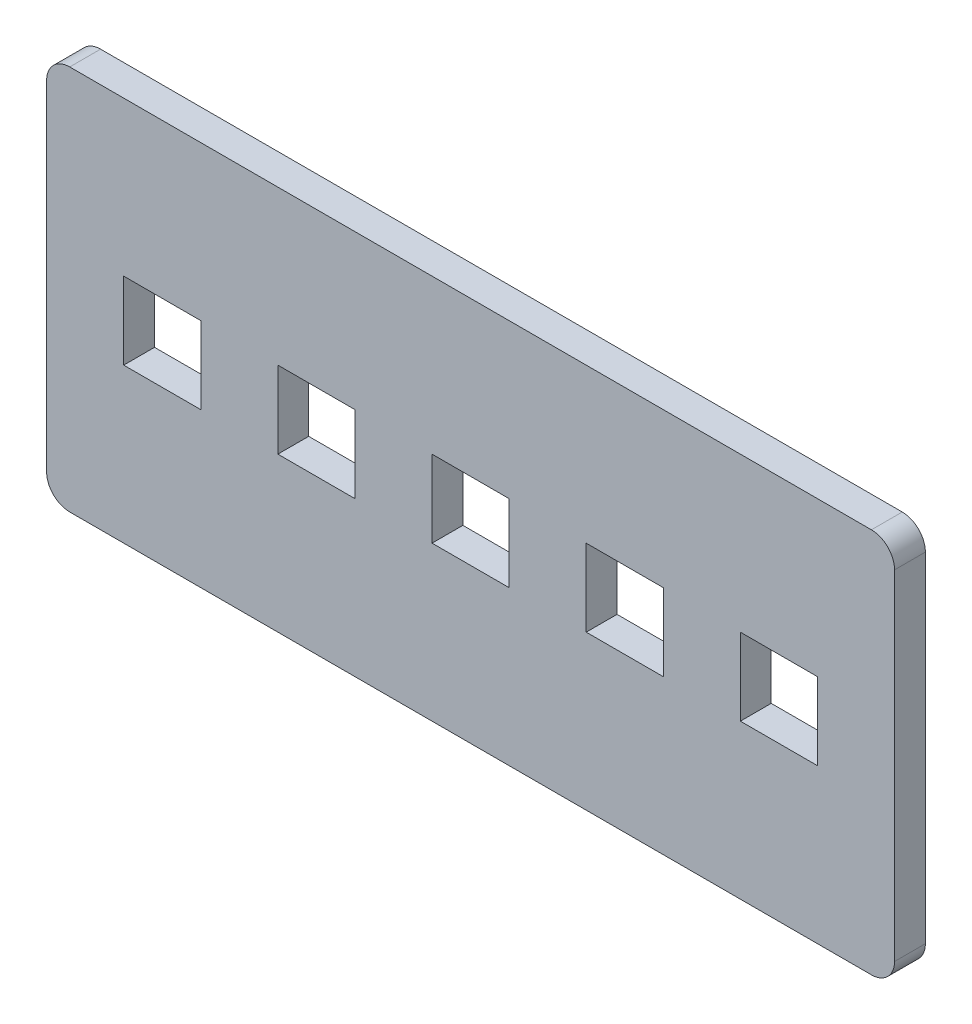
ISO-10303-21;
HEADER;
FILE_DESCRIPTION(('STEP AP214'),'2;1');
FILE_NAME('part.step','',(''),(''),'','','');
FILE_SCHEMA(('AUTOMOTIVE_DESIGN { 1 0 10303 214 1 1 1 1 }'));
ENDSEC;
DATA;
#1=APPLICATION_CONTEXT('core data for automotive mechanical design processes');
#2=APPLICATION_PROTOCOL_DEFINITION('international standard','automotive_design',2000,#1);
#3=PRODUCT_CONTEXT('',#1,'mechanical');
#4=PRODUCT('Part','Part','',(#3));
#5=PRODUCT_RELATED_PRODUCT_CATEGORY('part','',(#4));
#6=PRODUCT_DEFINITION_FORMATION('','',#4);
#7=PRODUCT_DEFINITION_CONTEXT('part definition',#1,'design');
#8=PRODUCT_DEFINITION('design','',#6,#7);
#9=PRODUCT_DEFINITION_SHAPE('','',#8);
#10=(LENGTH_UNIT() NAMED_UNIT(*) SI_UNIT(.MILLI.,.METRE.));
#11=(NAMED_UNIT(*) PLANE_ANGLE_UNIT() SI_UNIT($,.RADIAN.));
#12=(NAMED_UNIT(*) SI_UNIT($,.STERADIAN.) SOLID_ANGLE_UNIT());
#13=UNCERTAINTY_MEASURE_WITH_UNIT(LENGTH_MEASURE(1.E-05),#10,'distance_accuracy_value','');
#14=(GEOMETRIC_REPRESENTATION_CONTEXT(3) GLOBAL_UNCERTAINTY_ASSIGNED_CONTEXT((#13)) GLOBAL_UNIT_ASSIGNED_CONTEXT((#10,
#11,#12)) REPRESENTATION_CONTEXT('',''));
#15=CARTESIAN_POINT('',(0.,0.,0.));
#16=DIRECTION('',(0.,0.,1.));
#17=DIRECTION('',(1.,0.,0.));
#18=AXIS2_PLACEMENT_3D('',#15,#16,#17);
#19=CARTESIAN_POINT('',(0.,0.,4.));
#20=DIRECTION('',(0.,0.,1.));
#21=DIRECTION('',(1.,0.,0.));
#22=AXIS2_PLACEMENT_3D('',#19,#20,#21);
#23=PLANE('',#22);
#24=DIRECTION('',(0.,1.,0.));
#25=VECTOR('',#24,1.);
#26=CARTESIAN_POINT('',(55.,-25.,4.));
#27=LINE('',#26,#25);
#28=CARTESIAN_POINT('',(55.,-22.,4.));
#29=VERTEX_POINT('',#28);
#30=CARTESIAN_POINT('',(55.,22.,4.));
#31=VERTEX_POINT('',#30);
#32=EDGE_CURVE('E389',#29,#31,#27,.T.);
#33=ORIENTED_EDGE('',*,*,#32,.T.);
#34=CARTESIAN_POINT('',(52.,22.,4.));
#35=DIRECTION('',(0.,0.,1.));
#36=DIRECTION('',(1.,0.,0.));
#37=AXIS2_PLACEMENT_3D('',#34,#35,#36);
#38=CIRCLE('',#37,3.);
#39=CARTESIAN_POINT('',(52.,25.,4.));
#40=VERTEX_POINT('',#39);
#41=EDGE_CURVE('E427',#31,#40,#38,.T.);
#42=ORIENTED_EDGE('',*,*,#41,.T.);
#43=DIRECTION('',(-1.,0.,0.));
#44=VECTOR('',#43,1.);
#45=CARTESIAN_POINT('',(55.,25.,4.));
#46=LINE('',#45,#44);
#47=CARTESIAN_POINT('',(-52.,25.,4.));
#48=VERTEX_POINT('',#47);
#49=EDGE_CURVE('E392',#40,#48,#46,.T.);
#50=ORIENTED_EDGE('',*,*,#49,.T.);
#51=CARTESIAN_POINT('',(-52.,22.,4.));
#52=DIRECTION('',(0.,0.,1.));
#53=DIRECTION('',(1.,0.,0.));
#54=AXIS2_PLACEMENT_3D('',#51,#52,#53);
#55=CIRCLE('',#54,3.);
#56=CARTESIAN_POINT('',(-55.,22.,4.));
#57=VERTEX_POINT('',#56);
#58=EDGE_CURVE('E422',#48,#57,#55,.T.);
#59=ORIENTED_EDGE('',*,*,#58,.T.);
#60=DIRECTION('',(0.,-1.,0.));
#61=VECTOR('',#60,1.);
#62=CARTESIAN_POINT('',(-55.,-25.,4.));
#63=LINE('',#62,#61);
#64=CARTESIAN_POINT('',(-55.,-22.,4.));
#65=VERTEX_POINT('',#64);
#66=EDGE_CURVE('E384',#57,#65,#63,.T.);
#67=ORIENTED_EDGE('',*,*,#66,.T.);
#68=CARTESIAN_POINT('',(-52.,-22.,4.));
#69=DIRECTION('',(0.,0.,1.));
#70=DIRECTION('',(1.,0.,0.));
#71=AXIS2_PLACEMENT_3D('',#68,#69,#70);
#72=CIRCLE('',#71,3.);
#73=CARTESIAN_POINT('',(-52.,-25.,4.));
#74=VERTEX_POINT('',#73);
#75=EDGE_CURVE('E54',#65,#74,#72,.T.);
#76=ORIENTED_EDGE('',*,*,#75,.T.);
#77=DIRECTION('',(1.,0.,0.));
#78=VECTOR('',#77,1.);
#79=CARTESIAN_POINT('',(55.,-25.,4.));
#80=LINE('',#79,#78);
#81=CARTESIAN_POINT('',(52.,-25.,4.));
#82=VERTEX_POINT('',#81);
#83=EDGE_CURVE('E386',#74,#82,#80,.T.);
#84=ORIENTED_EDGE('',*,*,#83,.T.);
#85=CARTESIAN_POINT('',(52.,-22.,4.));
#86=DIRECTION('',(0.,0.,1.));
#87=DIRECTION('',(1.,0.,0.));
#88=AXIS2_PLACEMENT_3D('',#85,#86,#87);
#89=CIRCLE('',#88,3.);
#90=EDGE_CURVE('E425',#82,#29,#89,.T.);
#91=ORIENTED_EDGE('',*,*,#90,.T.);
#92=EDGE_LOOP('',(#33,#42,#50,#59,#67,#76,#84,#91));
#93=FACE_BOUND('',#92,.T.);
#94=DIRECTION('',(-1.,0.,0.));
#95=VECTOR('',#94,1.);
#96=CARTESIAN_POINT('',(-45.,5.,4.));
#97=LINE('',#96,#95);
#98=CARTESIAN_POINT('',(-35.,5.,4.));
#99=VERTEX_POINT('',#98);
#100=CARTESIAN_POINT('',(-45.,5.,4.));
#101=VERTEX_POINT('',#100);
#102=EDGE_CURVE('E355',#99,#101,#97,.T.);
#103=ORIENTED_EDGE('',*,*,#102,.F.);
#104=DIRECTION('',(0.,1.,0.));
#105=VECTOR('',#104,1.);
#106=CARTESIAN_POINT('',(-35.,5.,4.));
#107=LINE('',#106,#105);
#108=CARTESIAN_POINT('',(-35.,-5.,4.));
#109=VERTEX_POINT('',#108);
#110=EDGE_CURVE('E353',#109,#99,#107,.T.);
#111=ORIENTED_EDGE('',*,*,#110,.F.);
#112=DIRECTION('',(1.,0.,0.));
#113=VECTOR('',#112,1.);
#114=CARTESIAN_POINT('',(-45.,-5.,4.));
#115=LINE('',#114,#113);
#116=CARTESIAN_POINT('',(-45.,-5.,4.));
#117=VERTEX_POINT('',#116);
#118=EDGE_CURVE('E361',#117,#109,#115,.T.);
#119=ORIENTED_EDGE('',*,*,#118,.F.);
#120=DIRECTION('',(0.,-1.,0.));
#121=VECTOR('',#120,1.);
#122=CARTESIAN_POINT('',(-45.,5.,4.));
#123=LINE('',#122,#121);
#124=EDGE_CURVE('E358',#101,#117,#123,.T.);
#125=ORIENTED_EDGE('',*,*,#124,.F.);
#126=EDGE_LOOP('',(#103,#111,#119,#125));
#127=FACE_BOUND('',#126,.T.);
#128=DIRECTION('',(-1.,0.,0.));
#129=VECTOR('',#128,1.);
#130=CARTESIAN_POINT('',(-25.,5.,4.));
#131=LINE('',#130,#129);
#132=CARTESIAN_POINT('',(-15.,5.,4.));
#133=VERTEX_POINT('',#132);
#134=CARTESIAN_POINT('',(-25.,5.,4.));
#135=VERTEX_POINT('',#134);
#136=EDGE_CURVE('E324',#133,#135,#131,.T.);
#137=ORIENTED_EDGE('',*,*,#136,.F.);
#138=DIRECTION('',(0.,1.,0.));
#139=VECTOR('',#138,1.);
#140=CARTESIAN_POINT('',(-15.,5.,4.));
#141=LINE('',#140,#139);
#142=CARTESIAN_POINT('',(-15.,-5.,4.));
#143=VERTEX_POINT('',#142);
#144=EDGE_CURVE('E322',#143,#133,#141,.T.);
#145=ORIENTED_EDGE('',*,*,#144,.F.);
#146=DIRECTION('',(1.,0.,0.));
#147=VECTOR('',#146,1.);
#148=CARTESIAN_POINT('',(-25.,-5.,4.));
#149=LINE('',#148,#147);
#150=CARTESIAN_POINT('',(-25.,-5.,4.));
#151=VERTEX_POINT('',#150);
#152=EDGE_CURVE('E330',#151,#143,#149,.T.);
#153=ORIENTED_EDGE('',*,*,#152,.F.);
#154=DIRECTION('',(0.,-1.,0.));
#155=VECTOR('',#154,1.);
#156=CARTESIAN_POINT('',(-25.,5.,4.));
#157=LINE('',#156,#155);
#158=EDGE_CURVE('E327',#135,#151,#157,.T.);
#159=ORIENTED_EDGE('',*,*,#158,.F.);
#160=EDGE_LOOP('',(#137,#145,#153,#159));
#161=FACE_BOUND('',#160,.T.);
#162=DIRECTION('',(-1.,0.,0.));
#163=VECTOR('',#162,1.);
#164=CARTESIAN_POINT('',(-5.,5.,4.));
#165=LINE('',#164,#163);
#166=CARTESIAN_POINT('',(5.,5.,4.));
#167=VERTEX_POINT('',#166);
#168=CARTESIAN_POINT('',(-5.,5.,4.));
#169=VERTEX_POINT('',#168);
#170=EDGE_CURVE('E293',#167,#169,#165,.T.);
#171=ORIENTED_EDGE('',*,*,#170,.F.);
#172=DIRECTION('',(0.,1.,0.));
#173=VECTOR('',#172,1.);
#174=CARTESIAN_POINT('',(5.,5.,4.));
#175=LINE('',#174,#173);
#176=CARTESIAN_POINT('',(5.,-5.,4.));
#177=VERTEX_POINT('',#176);
#178=EDGE_CURVE('E291',#177,#167,#175,.T.);
#179=ORIENTED_EDGE('',*,*,#178,.F.);
#180=DIRECTION('',(1.,0.,0.));
#181=VECTOR('',#180,1.);
#182=CARTESIAN_POINT('',(-5.,-5.,4.));
#183=LINE('',#182,#181);
#184=CARTESIAN_POINT('',(-5.,-5.,4.));
#185=VERTEX_POINT('',#184);
#186=EDGE_CURVE('E299',#185,#177,#183,.T.);
#187=ORIENTED_EDGE('',*,*,#186,.F.);
#188=DIRECTION('',(0.,-1.,0.));
#189=VECTOR('',#188,1.);
#190=CARTESIAN_POINT('',(-5.,5.,4.));
#191=LINE('',#190,#189);
#192=EDGE_CURVE('E296',#169,#185,#191,.T.);
#193=ORIENTED_EDGE('',*,*,#192,.F.);
#194=EDGE_LOOP('',(#171,#179,#187,#193));
#195=FACE_BOUND('',#194,.T.);
#196=DIRECTION('',(-1.,0.,0.));
#197=VECTOR('',#196,1.);
#198=CARTESIAN_POINT('',(15.,5.,4.));
#199=LINE('',#198,#197);
#200=CARTESIAN_POINT('',(25.,5.,4.));
#201=VERTEX_POINT('',#200);
#202=CARTESIAN_POINT('',(15.,5.,4.));
#203=VERTEX_POINT('',#202);
#204=EDGE_CURVE('E262',#201,#203,#199,.T.);
#205=ORIENTED_EDGE('',*,*,#204,.F.);
#206=DIRECTION('',(0.,1.,0.));
#207=VECTOR('',#206,1.);
#208=CARTESIAN_POINT('',(25.,5.,4.));
#209=LINE('',#208,#207);
#210=CARTESIAN_POINT('',(25.,-5.,4.));
#211=VERTEX_POINT('',#210);
#212=EDGE_CURVE('E260',#211,#201,#209,.T.);
#213=ORIENTED_EDGE('',*,*,#212,.F.);
#214=DIRECTION('',(1.,0.,0.));
#215=VECTOR('',#214,1.);
#216=CARTESIAN_POINT('',(15.,-5.,4.));
#217=LINE('',#216,#215);
#218=CARTESIAN_POINT('',(15.,-5.,4.));
#219=VERTEX_POINT('',#218);
#220=EDGE_CURVE('E268',#219,#211,#217,.T.);
#221=ORIENTED_EDGE('',*,*,#220,.F.);
#222=DIRECTION('',(0.,-1.,0.));
#223=VECTOR('',#222,1.);
#224=CARTESIAN_POINT('',(15.,5.,4.));
#225=LINE('',#224,#223);
#226=EDGE_CURVE('E265',#203,#219,#225,.T.);
#227=ORIENTED_EDGE('',*,*,#226,.F.);
#228=EDGE_LOOP('',(#205,#213,#221,#227));
#229=FACE_BOUND('',#228,.T.);
#230=DIRECTION('',(-1.,0.,0.));
#231=VECTOR('',#230,1.);
#232=CARTESIAN_POINT('',(35.,5.,4.));
#233=LINE('',#232,#231);
#234=CARTESIAN_POINT('',(45.,5.,4.));
#235=VERTEX_POINT('',#234);
#236=CARTESIAN_POINT('',(35.,5.,4.));
#237=VERTEX_POINT('',#236);
#238=EDGE_CURVE('E229',#235,#237,#233,.T.);
#239=ORIENTED_EDGE('',*,*,#238,.F.);
#240=DIRECTION('',(0.,1.,0.));
#241=VECTOR('',#240,1.);
#242=CARTESIAN_POINT('',(45.,5.,4.));
#243=LINE('',#242,#241);
#244=CARTESIAN_POINT('',(45.,-5.,4.));
#245=VERTEX_POINT('',#244);
#246=EDGE_CURVE('E219',#245,#235,#243,.T.);
#247=ORIENTED_EDGE('',*,*,#246,.F.);
#248=DIRECTION('',(1.,0.,0.));
#249=VECTOR('',#248,1.);
#250=CARTESIAN_POINT('',(35.,-5.,4.));
#251=LINE('',#250,#249);
#252=CARTESIAN_POINT('',(35.,-5.,4.));
#253=VERTEX_POINT('',#252);
#254=EDGE_CURVE('E244',#253,#245,#251,.T.);
#255=ORIENTED_EDGE('',*,*,#254,.F.);
#256=DIRECTION('',(0.,-1.,0.));
#257=VECTOR('',#256,1.);
#258=CARTESIAN_POINT('',(35.,5.,4.));
#259=LINE('',#258,#257);
#260=EDGE_CURVE('E242',#237,#253,#259,.T.);
#261=ORIENTED_EDGE('',*,*,#260,.F.);
#262=EDGE_LOOP('',(#239,#247,#255,#261));
#263=FACE_BOUND('',#262,.T.);
#264=ADVANCED_FACE('F32',(#93,#127,#161,#195,#229,#263),#23,.T.);
#265=CARTESIAN_POINT('',(0.,0.,0.));
#266=DIRECTION('',(0.,0.,1.));
#267=DIRECTION('',(1.,0.,0.));
#268=AXIS2_PLACEMENT_3D('',#265,#266,#267);
#269=PLANE('',#268);
#270=DIRECTION('',(0.,1.,0.));
#271=VECTOR('',#270,1.);
#272=CARTESIAN_POINT('',(25.,5.,0.));
#273=LINE('',#272,#271);
#274=CARTESIAN_POINT('',(25.,-5.,0.));
#275=VERTEX_POINT('',#274);
#276=CARTESIAN_POINT('',(25.,5.,0.));
#277=VERTEX_POINT('',#276);
#278=EDGE_CURVE('E237',#275,#277,#273,.T.);
#279=ORIENTED_EDGE('',*,*,#278,.T.);
#280=DIRECTION('',(-1.,0.,0.));
#281=VECTOR('',#280,1.);
#282=CARTESIAN_POINT('',(15.,5.,0.));
#283=LINE('',#282,#281);
#284=CARTESIAN_POINT('',(15.,5.,0.));
#285=VERTEX_POINT('',#284);
#286=EDGE_CURVE('E273',#277,#285,#283,.T.);
#287=ORIENTED_EDGE('',*,*,#286,.T.);
#288=DIRECTION('',(0.,-1.,0.));
#289=VECTOR('',#288,1.);
#290=CARTESIAN_POINT('',(15.,5.,0.));
#291=LINE('',#290,#289);
#292=CARTESIAN_POINT('',(15.,-5.,0.));
#293=VERTEX_POINT('',#292);
#294=EDGE_CURVE('E276',#285,#293,#291,.T.);
#295=ORIENTED_EDGE('',*,*,#294,.T.);
#296=DIRECTION('',(1.,0.,0.));
#297=VECTOR('',#296,1.);
#298=CARTESIAN_POINT('',(15.,-5.,0.));
#299=LINE('',#298,#297);
#300=EDGE_CURVE('E263',#293,#275,#299,.T.);
#301=ORIENTED_EDGE('',*,*,#300,.T.);
#302=EDGE_LOOP('',(#279,#287,#295,#301));
#303=FACE_BOUND('',#302,.T.);
#304=DIRECTION('',(0.,1.,0.));
#305=VECTOR('',#304,1.);
#306=CARTESIAN_POINT('',(-15.,5.,0.));
#307=LINE('',#306,#305);
#308=CARTESIAN_POINT('',(-15.,-5.,0.));
#309=VERTEX_POINT('',#308);
#310=CARTESIAN_POINT('',(-15.,5.,0.));
#311=VERTEX_POINT('',#310);
#312=EDGE_CURVE('E321',#309,#311,#307,.T.);
#313=ORIENTED_EDGE('',*,*,#312,.T.);
#314=DIRECTION('',(-1.,0.,0.));
#315=VECTOR('',#314,1.);
#316=CARTESIAN_POINT('',(-25.,5.,0.));
#317=LINE('',#316,#315);
#318=CARTESIAN_POINT('',(-25.,5.,0.));
#319=VERTEX_POINT('',#318);
#320=EDGE_CURVE('E335',#311,#319,#317,.T.);
#321=ORIENTED_EDGE('',*,*,#320,.T.);
#322=DIRECTION('',(0.,-1.,0.));
#323=VECTOR('',#322,1.);
#324=CARTESIAN_POINT('',(-25.,5.,0.));
#325=LINE('',#324,#323);
#326=CARTESIAN_POINT('',(-25.,-5.,0.));
#327=VERTEX_POINT('',#326);
#328=EDGE_CURVE('E338',#319,#327,#325,.T.);
#329=ORIENTED_EDGE('',*,*,#328,.T.);
#330=DIRECTION('',(1.,0.,0.));
#331=VECTOR('',#330,1.);
#332=CARTESIAN_POINT('',(-25.,-5.,0.));
#333=LINE('',#332,#331);
#334=EDGE_CURVE('E325',#327,#309,#333,.T.);
#335=ORIENTED_EDGE('',*,*,#334,.T.);
#336=EDGE_LOOP('',(#313,#321,#329,#335));
#337=FACE_BOUND('',#336,.T.);
#338=DIRECTION('',(-1.,0.,0.));
#339=VECTOR('',#338,1.);
#340=CARTESIAN_POINT('',(55.,25.,0.));
#341=LINE('',#340,#339);
#342=CARTESIAN_POINT('',(52.,25.,0.));
#343=VERTEX_POINT('',#342);
#344=CARTESIAN_POINT('',(-52.,25.,0.));
#345=VERTEX_POINT('',#344);
#346=EDGE_CURVE('E387',#343,#345,#341,.T.);
#347=ORIENTED_EDGE('',*,*,#346,.F.);
#348=CARTESIAN_POINT('',(52.,22.,0.));
#349=DIRECTION('',(0.,0.,1.));
#350=DIRECTION('',(1.,0.,0.));
#351=AXIS2_PLACEMENT_3D('',#348,#349,#350);
#352=CIRCLE('',#351,3.);
#353=CARTESIAN_POINT('',(55.,22.,0.));
#354=VERTEX_POINT('',#353);
#355=EDGE_CURVE('E415',#343,#354,#352,.F.);
#356=ORIENTED_EDGE('',*,*,#355,.T.);
#357=DIRECTION('',(0.,1.,0.));
#358=VECTOR('',#357,1.);
#359=CARTESIAN_POINT('',(55.,-25.,0.));
#360=LINE('',#359,#358);
#361=CARTESIAN_POINT('',(55.,-22.,0.));
#362=VERTEX_POINT('',#361);
#363=EDGE_CURVE('E400',#362,#354,#360,.T.);
#364=ORIENTED_EDGE('',*,*,#363,.F.);
#365=CARTESIAN_POINT('',(52.,-22.,0.));
#366=DIRECTION('',(0.,0.,1.));
#367=DIRECTION('',(1.,0.,0.));
#368=AXIS2_PLACEMENT_3D('',#365,#366,#367);
#369=CIRCLE('',#368,3.);
#370=CARTESIAN_POINT('',(52.,-25.,0.));
#371=VERTEX_POINT('',#370);
#372=EDGE_CURVE('E413',#362,#371,#369,.F.);
#373=ORIENTED_EDGE('',*,*,#372,.T.);
#374=DIRECTION('',(1.,0.,0.));
#375=VECTOR('',#374,1.);
#376=CARTESIAN_POINT('',(55.,-25.,0.));
#377=LINE('',#376,#375);
#378=CARTESIAN_POINT('',(-52.,-25.,0.));
#379=VERTEX_POINT('',#378);
#380=EDGE_CURVE('E398',#379,#371,#377,.T.);
#381=ORIENTED_EDGE('',*,*,#380,.F.);
#382=CARTESIAN_POINT('',(-52.,-22.,0.));
#383=DIRECTION('',(0.,0.,1.));
#384=DIRECTION('',(1.,0.,0.));
#385=AXIS2_PLACEMENT_3D('',#382,#383,#384);
#386=CIRCLE('',#385,3.);
#387=CARTESIAN_POINT('',(-55.,-22.,0.));
#388=VERTEX_POINT('',#387);
#389=EDGE_CURVE('E411',#379,#388,#386,.F.);
#390=ORIENTED_EDGE('',*,*,#389,.T.);
#391=DIRECTION('',(0.,-1.,0.));
#392=VECTOR('',#391,1.);
#393=CARTESIAN_POINT('',(-55.,-25.,0.));
#394=LINE('',#393,#392);
#395=CARTESIAN_POINT('',(-55.,22.,0.));
#396=VERTEX_POINT('',#395);
#397=EDGE_CURVE('E383',#396,#388,#394,.T.);
#398=ORIENTED_EDGE('',*,*,#397,.F.);
#399=CARTESIAN_POINT('',(-52.,22.,0.));
#400=DIRECTION('',(0.,0.,1.));
#401=DIRECTION('',(1.,0.,0.));
#402=AXIS2_PLACEMENT_3D('',#399,#400,#401);
#403=CIRCLE('',#402,3.);
#404=EDGE_CURVE('E409',#396,#345,#403,.F.);
#405=ORIENTED_EDGE('',*,*,#404,.T.);
#406=EDGE_LOOP('',(#347,#356,#364,#373,#381,#390,#398,#405));
#407=FACE_BOUND('',#406,.T.);
#408=DIRECTION('',(0.,1.,0.));
#409=VECTOR('',#408,1.);
#410=CARTESIAN_POINT('',(-35.,5.,0.));
#411=LINE('',#410,#409);
#412=CARTESIAN_POINT('',(-35.,-5.,0.));
#413=VERTEX_POINT('',#412);
#414=CARTESIAN_POINT('',(-35.,5.,0.));
#415=VERTEX_POINT('',#414);
#416=EDGE_CURVE('E352',#413,#415,#411,.T.);
#417=ORIENTED_EDGE('',*,*,#416,.T.);
#418=DIRECTION('',(-1.,0.,0.));
#419=VECTOR('',#418,1.);
#420=CARTESIAN_POINT('',(-45.,5.,0.));
#421=LINE('',#420,#419);
#422=CARTESIAN_POINT('',(-45.,5.,0.));
#423=VERTEX_POINT('',#422);
#424=EDGE_CURVE('E366',#415,#423,#421,.T.);
#425=ORIENTED_EDGE('',*,*,#424,.T.);
#426=DIRECTION('',(0.,-1.,0.));
#427=VECTOR('',#426,1.);
#428=CARTESIAN_POINT('',(-45.,5.,0.));
#429=LINE('',#428,#427);
#430=CARTESIAN_POINT('',(-45.,-5.,0.));
#431=VERTEX_POINT('',#430);
#432=EDGE_CURVE('E369',#423,#431,#429,.T.);
#433=ORIENTED_EDGE('',*,*,#432,.T.);
#434=DIRECTION('',(1.,0.,0.));
#435=VECTOR('',#434,1.);
#436=CARTESIAN_POINT('',(-45.,-5.,0.));
#437=LINE('',#436,#435);
#438=EDGE_CURVE('E356',#431,#413,#437,.T.);
#439=ORIENTED_EDGE('',*,*,#438,.T.);
#440=EDGE_LOOP('',(#417,#425,#433,#439));
#441=FACE_BOUND('',#440,.T.);
#442=DIRECTION('',(0.,1.,0.));
#443=VECTOR('',#442,1.);
#444=CARTESIAN_POINT('',(5.,5.,0.));
#445=LINE('',#444,#443);
#446=CARTESIAN_POINT('',(5.,-5.,0.));
#447=VERTEX_POINT('',#446);
#448=CARTESIAN_POINT('',(5.,5.,0.));
#449=VERTEX_POINT('',#448);
#450=EDGE_CURVE('E290',#447,#449,#445,.T.);
#451=ORIENTED_EDGE('',*,*,#450,.T.);
#452=DIRECTION('',(-1.,0.,0.));
#453=VECTOR('',#452,1.);
#454=CARTESIAN_POINT('',(-5.,5.,0.));
#455=LINE('',#454,#453);
#456=CARTESIAN_POINT('',(-5.,5.,0.));
#457=VERTEX_POINT('',#456);
#458=EDGE_CURVE('E304',#449,#457,#455,.T.);
#459=ORIENTED_EDGE('',*,*,#458,.T.);
#460=DIRECTION('',(0.,-1.,0.));
#461=VECTOR('',#460,1.);
#462=CARTESIAN_POINT('',(-5.,5.,0.));
#463=LINE('',#462,#461);
#464=CARTESIAN_POINT('',(-5.,-5.,0.));
#465=VERTEX_POINT('',#464);
#466=EDGE_CURVE('E307',#457,#465,#463,.T.);
#467=ORIENTED_EDGE('',*,*,#466,.T.);
#468=DIRECTION('',(1.,0.,0.));
#469=VECTOR('',#468,1.);
#470=CARTESIAN_POINT('',(-5.,-5.,0.));
#471=LINE('',#470,#469);
#472=EDGE_CURVE('E294',#465,#447,#471,.T.);
#473=ORIENTED_EDGE('',*,*,#472,.T.);
#474=EDGE_LOOP('',(#451,#459,#467,#473));
#475=FACE_BOUND('',#474,.T.);
#476=DIRECTION('',(0.,1.,0.));
#477=VECTOR('',#476,1.);
#478=CARTESIAN_POINT('',(45.,5.,0.));
#479=LINE('',#478,#477);
#480=CARTESIAN_POINT('',(45.,-5.,0.));
#481=VERTEX_POINT('',#480);
#482=CARTESIAN_POINT('',(45.,5.,0.));
#483=VERTEX_POINT('',#482);
#484=EDGE_CURVE('E248',#481,#483,#479,.T.);
#485=ORIENTED_EDGE('',*,*,#484,.T.);
#486=DIRECTION('',(-1.,0.,0.));
#487=VECTOR('',#486,1.);
#488=CARTESIAN_POINT('',(35.,5.,0.));
#489=LINE('',#488,#487);
#490=CARTESIAN_POINT('',(35.,5.,0.));
#491=VERTEX_POINT('',#490);
#492=EDGE_CURVE('E236',#483,#491,#489,.T.);
#493=ORIENTED_EDGE('',*,*,#492,.T.);
#494=DIRECTION('',(0.,-1.,0.));
#495=VECTOR('',#494,1.);
#496=CARTESIAN_POINT('',(35.,5.,0.));
#497=LINE('',#496,#495);
#498=CARTESIAN_POINT('',(35.,-5.,0.));
#499=VERTEX_POINT('',#498);
#500=EDGE_CURVE('E251',#491,#499,#497,.T.);
#501=ORIENTED_EDGE('',*,*,#500,.T.);
#502=DIRECTION('',(1.,0.,0.));
#503=VECTOR('',#502,1.);
#504=CARTESIAN_POINT('',(35.,-5.,0.));
#505=LINE('',#504,#503);
#506=EDGE_CURVE('E230',#499,#481,#505,.T.);
#507=ORIENTED_EDGE('',*,*,#506,.T.);
#508=EDGE_LOOP('',(#485,#493,#501,#507));
#509=FACE_BOUND('',#508,.T.);
#510=ADVANCED_FACE('F443',(#303,#337,#407,#441,#475,#509),#269,.F.);
#511=CARTESIAN_POINT('',(-55.,-25.,4.));
#512=DIRECTION('',(1.,0.,0.));
#513=DIRECTION('',(0.,0.,-1.));
#514=AXIS2_PLACEMENT_3D('',#511,#512,#513);
#515=PLANE('',#514);
#516=ORIENTED_EDGE('',*,*,#397,.T.);
#517=DIRECTION('',(0.,0.,-1.));
#518=VECTOR('',#517,1.);
#519=CARTESIAN_POINT('',(-55.,-22.,4.));
#520=LINE('',#519,#518);
#521=EDGE_CURVE('E11',#388,#65,#520,.F.);
#522=ORIENTED_EDGE('',*,*,#521,.T.);
#523=ORIENTED_EDGE('',*,*,#66,.F.);
#524=DIRECTION('',(0.,0.,-1.));
#525=VECTOR('',#524,1.);
#526=CARTESIAN_POINT('',(-55.,22.,4.));
#527=LINE('',#526,#525);
#528=EDGE_CURVE('E40',#57,#396,#527,.T.);
#529=ORIENTED_EDGE('',*,*,#528,.T.);
#530=EDGE_LOOP('',(#516,#522,#523,#529));
#531=FACE_BOUND('',#530,.T.);
#532=ADVANCED_FACE('F437',(#531),#515,.F.);
#533=CARTESIAN_POINT('',(55.,-25.,4.));
#534=DIRECTION('',(0.,1.,0.));
#535=DIRECTION('',(-1.,0.,0.));
#536=AXIS2_PLACEMENT_3D('',#533,#534,#535);
#537=PLANE('',#536);
#538=ORIENTED_EDGE('',*,*,#380,.T.);
#539=DIRECTION('',(0.,0.,-1.));
#540=VECTOR('',#539,1.);
#541=CARTESIAN_POINT('',(52.,-25.,4.));
#542=LINE('',#541,#540);
#543=EDGE_CURVE('E47',#371,#82,#542,.F.);
#544=ORIENTED_EDGE('',*,*,#543,.T.);
#545=ORIENTED_EDGE('',*,*,#83,.F.);
#546=DIRECTION('',(0.,0.,-1.));
#547=VECTOR('',#546,1.);
#548=CARTESIAN_POINT('',(-52.,-25.,4.));
#549=LINE('',#548,#547);
#550=EDGE_CURVE('E429',#74,#379,#549,.T.);
#551=ORIENTED_EDGE('',*,*,#550,.T.);
#552=EDGE_LOOP('',(#538,#544,#545,#551));
#553=FACE_BOUND('',#552,.T.);
#554=ADVANCED_FACE('F449',(#553),#537,.F.);
#555=CARTESIAN_POINT('',(55.,-25.,4.));
#556=DIRECTION('',(-1.,0.,0.));
#557=DIRECTION('',(0.,-1.,0.));
#558=AXIS2_PLACEMENT_3D('',#555,#556,#557);
#559=PLANE('',#558);
#560=ORIENTED_EDGE('',*,*,#363,.T.);
#561=DIRECTION('',(0.,0.,-1.));
#562=VECTOR('',#561,1.);
#563=CARTESIAN_POINT('',(55.,22.,4.));
#564=LINE('',#563,#562);
#565=EDGE_CURVE('E420',#354,#31,#564,.F.);
#566=ORIENTED_EDGE('',*,*,#565,.T.);
#567=ORIENTED_EDGE('',*,*,#32,.F.);
#568=DIRECTION('',(0.,0.,-1.));
#569=VECTOR('',#568,1.);
#570=CARTESIAN_POINT('',(55.,-22.,4.));
#571=LINE('',#570,#569);
#572=EDGE_CURVE('E417',#29,#362,#571,.T.);
#573=ORIENTED_EDGE('',*,*,#572,.T.);
#574=EDGE_LOOP('',(#560,#566,#567,#573));
#575=FACE_BOUND('',#574,.T.);
#576=ADVANCED_FACE('F458',(#575),#559,.F.);
#577=CARTESIAN_POINT('',(55.,25.,4.));
#578=DIRECTION('',(0.,-1.,0.));
#579=DIRECTION('',(1.,0.,0.));
#580=AXIS2_PLACEMENT_3D('',#577,#578,#579);
#581=PLANE('',#580);
#582=ORIENTED_EDGE('',*,*,#49,.F.);
#583=DIRECTION('',(0.,0.,-1.));
#584=VECTOR('',#583,1.);
#585=CARTESIAN_POINT('',(52.,25.,4.));
#586=LINE('',#585,#584);
#587=EDGE_CURVE('E406',#40,#343,#586,.T.);
#588=ORIENTED_EDGE('',*,*,#587,.T.);
#589=ORIENTED_EDGE('',*,*,#346,.T.);
#590=DIRECTION('',(0.,0.,-1.));
#591=VECTOR('',#590,1.);
#592=CARTESIAN_POINT('',(-52.,25.,4.));
#593=LINE('',#592,#591);
#594=EDGE_CURVE('E395',#345,#48,#593,.F.);
#595=ORIENTED_EDGE('',*,*,#594,.T.);
#596=EDGE_LOOP('',(#582,#588,#589,#595));
#597=FACE_BOUND('',#596,.T.);
#598=ADVANCED_FACE('F466',(#597),#581,.F.);
#599=CARTESIAN_POINT('',(-35.,5.,4.));
#600=DIRECTION('',(-1.,0.,0.));
#601=DIRECTION('',(0.,0.,1.));
#602=AXIS2_PLACEMENT_3D('',#599,#600,#601);
#603=PLANE('',#602);
#604=ORIENTED_EDGE('',*,*,#416,.F.);
#605=DIRECTION('',(0.,0.,-1.));
#606=VECTOR('',#605,1.);
#607=CARTESIAN_POINT('',(-35.,-5.,4.));
#608=LINE('',#607,#606);
#609=EDGE_CURVE('E363',#109,#413,#608,.T.);
#610=ORIENTED_EDGE('',*,*,#609,.F.);
#611=ORIENTED_EDGE('',*,*,#110,.T.);
#612=DIRECTION('',(0.,0.,-1.));
#613=VECTOR('',#612,1.);
#614=CARTESIAN_POINT('',(-35.,5.,4.));
#615=LINE('',#614,#613);
#616=EDGE_CURVE('E380',#99,#415,#615,.T.);
#617=ORIENTED_EDGE('',*,*,#616,.T.);
#618=EDGE_LOOP('',(#604,#610,#611,#617));
#619=FACE_BOUND('',#618,.T.);
#620=ADVANCED_FACE('F480',(#619),#603,.T.);
#621=CARTESIAN_POINT('',(-45.,5.,4.));
#622=DIRECTION('',(0.,-1.,0.));
#623=DIRECTION('',(0.,0.,-1.));
#624=AXIS2_PLACEMENT_3D('',#621,#622,#623);
#625=PLANE('',#624);
#626=ORIENTED_EDGE('',*,*,#424,.F.);
#627=ORIENTED_EDGE('',*,*,#616,.F.);
#628=ORIENTED_EDGE('',*,*,#102,.T.);
#629=DIRECTION('',(0.,0.,-1.));
#630=VECTOR('',#629,1.);
#631=CARTESIAN_POINT('',(-45.,5.,4.));
#632=LINE('',#631,#630);
#633=EDGE_CURVE('E378',#101,#423,#632,.T.);
#634=ORIENTED_EDGE('',*,*,#633,.T.);
#635=EDGE_LOOP('',(#626,#627,#628,#634));
#636=FACE_BOUND('',#635,.T.);
#637=ADVANCED_FACE('F673',(#636),#625,.T.);
#638=CARTESIAN_POINT('',(-45.,5.,4.));
#639=DIRECTION('',(1.,0.,0.));
#640=DIRECTION('',(0.,0.,-1.));
#641=AXIS2_PLACEMENT_3D('',#638,#639,#640);
#642=PLANE('',#641);
#643=ORIENTED_EDGE('',*,*,#432,.F.);
#644=ORIENTED_EDGE('',*,*,#633,.F.);
#645=ORIENTED_EDGE('',*,*,#124,.T.);
#646=DIRECTION('',(0.,0.,-1.));
#647=VECTOR('',#646,1.);
#648=CARTESIAN_POINT('',(-45.,-5.,4.));
#649=LINE('',#648,#647);
#650=EDGE_CURVE('E376',#117,#431,#649,.T.);
#651=ORIENTED_EDGE('',*,*,#650,.T.);
#652=EDGE_LOOP('',(#643,#644,#645,#651));
#653=FACE_BOUND('',#652,.T.);
#654=ADVANCED_FACE('F664',(#653),#642,.T.);
#655=CARTESIAN_POINT('',(-45.,-5.,4.));
#656=DIRECTION('',(0.,1.,0.));
#657=DIRECTION('',(0.,0.,1.));
#658=AXIS2_PLACEMENT_3D('',#655,#656,#657);
#659=PLANE('',#658);
#660=ORIENTED_EDGE('',*,*,#438,.F.);
#661=ORIENTED_EDGE('',*,*,#650,.F.);
#662=ORIENTED_EDGE('',*,*,#118,.T.);
#663=ORIENTED_EDGE('',*,*,#609,.T.);
#664=EDGE_LOOP('',(#660,#661,#662,#663));
#665=FACE_BOUND('',#664,.T.);
#666=ADVANCED_FACE('F655',(#665),#659,.T.);
#667=CARTESIAN_POINT('',(-15.,5.,4.));
#668=DIRECTION('',(-1.,0.,0.));
#669=DIRECTION('',(0.,0.,1.));
#670=AXIS2_PLACEMENT_3D('',#667,#668,#669);
#671=PLANE('',#670);
#672=ORIENTED_EDGE('',*,*,#312,.F.);
#673=DIRECTION('',(0.,0.,-1.));
#674=VECTOR('',#673,1.);
#675=CARTESIAN_POINT('',(-15.,-5.,4.));
#676=LINE('',#675,#674);
#677=EDGE_CURVE('E332',#143,#309,#676,.T.);
#678=ORIENTED_EDGE('',*,*,#677,.F.);
#679=ORIENTED_EDGE('',*,*,#144,.T.);
#680=DIRECTION('',(0.,0.,-1.));
#681=VECTOR('',#680,1.);
#682=CARTESIAN_POINT('',(-15.,5.,4.));
#683=LINE('',#682,#681);
#684=EDGE_CURVE('E349',#133,#311,#683,.T.);
#685=ORIENTED_EDGE('',*,*,#684,.T.);
#686=EDGE_LOOP('',(#672,#678,#679,#685));
#687=FACE_BOUND('',#686,.T.);
#688=ADVANCED_FACE('F646',(#687),#671,.T.);
#689=CARTESIAN_POINT('',(-25.,5.,4.));
#690=DIRECTION('',(0.,-1.,0.));
#691=DIRECTION('',(0.,0.,-1.));
#692=AXIS2_PLACEMENT_3D('',#689,#690,#691);
#693=PLANE('',#692);
#694=ORIENTED_EDGE('',*,*,#320,.F.);
#695=ORIENTED_EDGE('',*,*,#684,.F.);
#696=ORIENTED_EDGE('',*,*,#136,.T.);
#697=DIRECTION('',(0.,0.,-1.));
#698=VECTOR('',#697,1.);
#699=CARTESIAN_POINT('',(-25.,5.,4.));
#700=LINE('',#699,#698);
#701=EDGE_CURVE('E347',#135,#319,#700,.T.);
#702=ORIENTED_EDGE('',*,*,#701,.T.);
#703=EDGE_LOOP('',(#694,#695,#696,#702));
#704=FACE_BOUND('',#703,.T.);
#705=ADVANCED_FACE('F637',(#704),#693,.T.);
#706=CARTESIAN_POINT('',(-25.,5.,4.));
#707=DIRECTION('',(1.,0.,0.));
#708=DIRECTION('',(0.,0.,-1.));
#709=AXIS2_PLACEMENT_3D('',#706,#707,#708);
#710=PLANE('',#709);
#711=ORIENTED_EDGE('',*,*,#328,.F.);
#712=ORIENTED_EDGE('',*,*,#701,.F.);
#713=ORIENTED_EDGE('',*,*,#158,.T.);
#714=DIRECTION('',(0.,0.,-1.));
#715=VECTOR('',#714,1.);
#716=CARTESIAN_POINT('',(-25.,-5.,4.));
#717=LINE('',#716,#715);
#718=EDGE_CURVE('E345',#151,#327,#717,.T.);
#719=ORIENTED_EDGE('',*,*,#718,.T.);
#720=EDGE_LOOP('',(#711,#712,#713,#719));
#721=FACE_BOUND('',#720,.T.);
#722=ADVANCED_FACE('F628',(#721),#710,.T.);
#723=CARTESIAN_POINT('',(-25.,-5.,4.));
#724=DIRECTION('',(0.,1.,0.));
#725=DIRECTION('',(0.,0.,1.));
#726=AXIS2_PLACEMENT_3D('',#723,#724,#725);
#727=PLANE('',#726);
#728=ORIENTED_EDGE('',*,*,#334,.F.);
#729=ORIENTED_EDGE('',*,*,#718,.F.);
#730=ORIENTED_EDGE('',*,*,#152,.T.);
#731=ORIENTED_EDGE('',*,*,#677,.T.);
#732=EDGE_LOOP('',(#728,#729,#730,#731));
#733=FACE_BOUND('',#732,.T.);
#734=ADVANCED_FACE('F619',(#733),#727,.T.);
#735=CARTESIAN_POINT('',(5.,5.,4.));
#736=DIRECTION('',(-1.,0.,0.));
#737=DIRECTION('',(0.,0.,1.));
#738=AXIS2_PLACEMENT_3D('',#735,#736,#737);
#739=PLANE('',#738);
#740=ORIENTED_EDGE('',*,*,#450,.F.);
#741=DIRECTION('',(0.,0.,-1.));
#742=VECTOR('',#741,1.);
#743=CARTESIAN_POINT('',(5.,-5.,4.));
#744=LINE('',#743,#742);
#745=EDGE_CURVE('E301',#177,#447,#744,.T.);
#746=ORIENTED_EDGE('',*,*,#745,.F.);
#747=ORIENTED_EDGE('',*,*,#178,.T.);
#748=DIRECTION('',(0.,0.,-1.));
#749=VECTOR('',#748,1.);
#750=CARTESIAN_POINT('',(5.,5.,4.));
#751=LINE('',#750,#749);
#752=EDGE_CURVE('E318',#167,#449,#751,.T.);
#753=ORIENTED_EDGE('',*,*,#752,.T.);
#754=EDGE_LOOP('',(#740,#746,#747,#753));
#755=FACE_BOUND('',#754,.T.);
#756=ADVANCED_FACE('F610',(#755),#739,.T.);
#757=CARTESIAN_POINT('',(-5.,5.,4.));
#758=DIRECTION('',(0.,-1.,0.));
#759=DIRECTION('',(0.,0.,-1.));
#760=AXIS2_PLACEMENT_3D('',#757,#758,#759);
#761=PLANE('',#760);
#762=ORIENTED_EDGE('',*,*,#458,.F.);
#763=ORIENTED_EDGE('',*,*,#752,.F.);
#764=ORIENTED_EDGE('',*,*,#170,.T.);
#765=DIRECTION('',(0.,0.,-1.));
#766=VECTOR('',#765,1.);
#767=CARTESIAN_POINT('',(-5.,5.,4.));
#768=LINE('',#767,#766);
#769=EDGE_CURVE('E316',#169,#457,#768,.T.);
#770=ORIENTED_EDGE('',*,*,#769,.T.);
#771=EDGE_LOOP('',(#762,#763,#764,#770));
#772=FACE_BOUND('',#771,.T.);
#773=ADVANCED_FACE('F601',(#772),#761,.T.);
#774=CARTESIAN_POINT('',(-5.,5.,4.));
#775=DIRECTION('',(1.,0.,0.));
#776=DIRECTION('',(0.,0.,-1.));
#777=AXIS2_PLACEMENT_3D('',#774,#775,#776);
#778=PLANE('',#777);
#779=ORIENTED_EDGE('',*,*,#466,.F.);
#780=ORIENTED_EDGE('',*,*,#769,.F.);
#781=ORIENTED_EDGE('',*,*,#192,.T.);
#782=DIRECTION('',(0.,0.,-1.));
#783=VECTOR('',#782,1.);
#784=CARTESIAN_POINT('',(-5.,-5.,4.));
#785=LINE('',#784,#783);
#786=EDGE_CURVE('E314',#185,#465,#785,.T.);
#787=ORIENTED_EDGE('',*,*,#786,.T.);
#788=EDGE_LOOP('',(#779,#780,#781,#787));
#789=FACE_BOUND('',#788,.T.);
#790=ADVANCED_FACE('F592',(#789),#778,.T.);
#791=CARTESIAN_POINT('',(-5.,-5.,4.));
#792=DIRECTION('',(0.,1.,0.));
#793=DIRECTION('',(0.,0.,1.));
#794=AXIS2_PLACEMENT_3D('',#791,#792,#793);
#795=PLANE('',#794);
#796=ORIENTED_EDGE('',*,*,#472,.F.);
#797=ORIENTED_EDGE('',*,*,#786,.F.);
#798=ORIENTED_EDGE('',*,*,#186,.T.);
#799=ORIENTED_EDGE('',*,*,#745,.T.);
#800=EDGE_LOOP('',(#796,#797,#798,#799));
#801=FACE_BOUND('',#800,.T.);
#802=ADVANCED_FACE('F583',(#801),#795,.T.);
#803=CARTESIAN_POINT('',(25.,5.,4.));
#804=DIRECTION('',(-1.,0.,0.));
#805=DIRECTION('',(0.,0.,1.));
#806=AXIS2_PLACEMENT_3D('',#803,#804,#805);
#807=PLANE('',#806);
#808=ORIENTED_EDGE('',*,*,#278,.F.);
#809=DIRECTION('',(0.,0.,-1.));
#810=VECTOR('',#809,1.);
#811=CARTESIAN_POINT('',(25.,-5.,4.));
#812=LINE('',#811,#810);
#813=EDGE_CURVE('E270',#211,#275,#812,.T.);
#814=ORIENTED_EDGE('',*,*,#813,.F.);
#815=ORIENTED_EDGE('',*,*,#212,.T.);
#816=DIRECTION('',(0.,0.,-1.));
#817=VECTOR('',#816,1.);
#818=CARTESIAN_POINT('',(25.,5.,4.));
#819=LINE('',#818,#817);
#820=EDGE_CURVE('E287',#201,#277,#819,.T.);
#821=ORIENTED_EDGE('',*,*,#820,.T.);
#822=EDGE_LOOP('',(#808,#814,#815,#821));
#823=FACE_BOUND('',#822,.T.);
#824=ADVANCED_FACE('F574',(#823),#807,.T.);
#825=CARTESIAN_POINT('',(15.,5.,4.));
#826=DIRECTION('',(0.,-1.,0.));
#827=DIRECTION('',(0.,0.,-1.));
#828=AXIS2_PLACEMENT_3D('',#825,#826,#827);
#829=PLANE('',#828);
#830=ORIENTED_EDGE('',*,*,#286,.F.);
#831=ORIENTED_EDGE('',*,*,#820,.F.);
#832=ORIENTED_EDGE('',*,*,#204,.T.);
#833=DIRECTION('',(0.,0.,-1.));
#834=VECTOR('',#833,1.);
#835=CARTESIAN_POINT('',(15.,5.,4.));
#836=LINE('',#835,#834);
#837=EDGE_CURVE('E285',#203,#285,#836,.T.);
#838=ORIENTED_EDGE('',*,*,#837,.T.);
#839=EDGE_LOOP('',(#830,#831,#832,#838));
#840=FACE_BOUND('',#839,.T.);
#841=ADVANCED_FACE('F565',(#840),#829,.T.);
#842=CARTESIAN_POINT('',(15.,5.,4.));
#843=DIRECTION('',(1.,0.,0.));
#844=DIRECTION('',(0.,0.,-1.));
#845=AXIS2_PLACEMENT_3D('',#842,#843,#844);
#846=PLANE('',#845);
#847=ORIENTED_EDGE('',*,*,#294,.F.);
#848=ORIENTED_EDGE('',*,*,#837,.F.);
#849=ORIENTED_EDGE('',*,*,#226,.T.);
#850=DIRECTION('',(0.,0.,-1.));
#851=VECTOR('',#850,1.);
#852=CARTESIAN_POINT('',(15.,-5.,4.));
#853=LINE('',#852,#851);
#854=EDGE_CURVE('E283',#219,#293,#853,.T.);
#855=ORIENTED_EDGE('',*,*,#854,.T.);
#856=EDGE_LOOP('',(#847,#848,#849,#855));
#857=FACE_BOUND('',#856,.T.);
#858=ADVANCED_FACE('F556',(#857),#846,.T.);
#859=CARTESIAN_POINT('',(15.,-5.,4.));
#860=DIRECTION('',(0.,1.,0.));
#861=DIRECTION('',(0.,0.,1.));
#862=AXIS2_PLACEMENT_3D('',#859,#860,#861);
#863=PLANE('',#862);
#864=ORIENTED_EDGE('',*,*,#300,.F.);
#865=ORIENTED_EDGE('',*,*,#854,.F.);
#866=ORIENTED_EDGE('',*,*,#220,.T.);
#867=ORIENTED_EDGE('',*,*,#813,.T.);
#868=EDGE_LOOP('',(#864,#865,#866,#867));
#869=FACE_BOUND('',#868,.T.);
#870=ADVANCED_FACE('F548',(#869),#863,.T.);
#871=CARTESIAN_POINT('',(45.,5.,4.));
#872=DIRECTION('',(-1.,0.,0.));
#873=DIRECTION('',(0.,0.,1.));
#874=AXIS2_PLACEMENT_3D('',#871,#872,#873);
#875=PLANE('',#874);
#876=ORIENTED_EDGE('',*,*,#484,.F.);
#877=DIRECTION('',(0.,0.,-1.));
#878=VECTOR('',#877,1.);
#879=CARTESIAN_POINT('',(45.,-5.,4.));
#880=LINE('',#879,#878);
#881=EDGE_CURVE('E225',#245,#481,#880,.T.);
#882=ORIENTED_EDGE('',*,*,#881,.F.);
#883=ORIENTED_EDGE('',*,*,#246,.T.);
#884=DIRECTION('',(0.,0.,-1.));
#885=VECTOR('',#884,1.);
#886=CARTESIAN_POINT('',(45.,5.,4.));
#887=LINE('',#886,#885);
#888=EDGE_CURVE('E222',#235,#483,#887,.T.);
#889=ORIENTED_EDGE('',*,*,#888,.T.);
#890=EDGE_LOOP('',(#876,#882,#883,#889));
#891=FACE_BOUND('',#890,.T.);
#892=ADVANCED_FACE('F221',(#891),#875,.T.);
#893=CARTESIAN_POINT('',(35.,5.,4.));
#894=DIRECTION('',(0.,-1.,0.));
#895=DIRECTION('',(0.,0.,-1.));
#896=AXIS2_PLACEMENT_3D('',#893,#894,#895);
#897=PLANE('',#896);
#898=ORIENTED_EDGE('',*,*,#492,.F.);
#899=ORIENTED_EDGE('',*,*,#888,.F.);
#900=ORIENTED_EDGE('',*,*,#238,.T.);
#901=DIRECTION('',(0.,0.,-1.));
#902=VECTOR('',#901,1.);
#903=CARTESIAN_POINT('',(35.,5.,4.));
#904=LINE('',#903,#902);
#905=EDGE_CURVE('E238',#237,#491,#904,.T.);
#906=ORIENTED_EDGE('',*,*,#905,.T.);
#907=EDGE_LOOP('',(#898,#899,#900,#906));
#908=FACE_BOUND('',#907,.T.);
#909=ADVANCED_FACE('F233',(#908),#897,.T.);
#910=CARTESIAN_POINT('',(35.,5.,4.));
#911=DIRECTION('',(1.,0.,0.));
#912=DIRECTION('',(0.,0.,-1.));
#913=AXIS2_PLACEMENT_3D('',#910,#911,#912);
#914=PLANE('',#913);
#915=ORIENTED_EDGE('',*,*,#500,.F.);
#916=ORIENTED_EDGE('',*,*,#905,.F.);
#917=ORIENTED_EDGE('',*,*,#260,.T.);
#918=DIRECTION('',(0.,0.,-1.));
#919=VECTOR('',#918,1.);
#920=CARTESIAN_POINT('',(35.,-5.,4.));
#921=LINE('',#920,#919);
#922=EDGE_CURVE('E257',#253,#499,#921,.T.);
#923=ORIENTED_EDGE('',*,*,#922,.T.);
#924=EDGE_LOOP('',(#915,#916,#917,#923));
#925=FACE_BOUND('',#924,.T.);
#926=ADVANCED_FACE('F524',(#925),#914,.T.);
#927=CARTESIAN_POINT('',(35.,-5.,4.));
#928=DIRECTION('',(0.,1.,0.));
#929=DIRECTION('',(0.,0.,1.));
#930=AXIS2_PLACEMENT_3D('',#927,#928,#929);
#931=PLANE('',#930);
#932=ORIENTED_EDGE('',*,*,#506,.F.);
#933=ORIENTED_EDGE('',*,*,#922,.F.);
#934=ORIENTED_EDGE('',*,*,#254,.T.);
#935=ORIENTED_EDGE('',*,*,#881,.T.);
#936=EDGE_LOOP('',(#932,#933,#934,#935));
#937=FACE_BOUND('',#936,.T.);
#938=ADVANCED_FACE('F493',(#937),#931,.T.);
#939=CARTESIAN_POINT('',(52.,22.,4.));
#940=DIRECTION('',(0.,0.,-1.));
#941=DIRECTION('',(-1.,0.,0.));
#942=AXIS2_PLACEMENT_3D('',#939,#940,#941);
#943=CYLINDRICAL_SURFACE('',#942,3.);
#944=ORIENTED_EDGE('',*,*,#41,.F.);
#945=ORIENTED_EDGE('',*,*,#565,.F.);
#946=ORIENTED_EDGE('',*,*,#355,.F.);
#947=ORIENTED_EDGE('',*,*,#587,.F.);
#948=EDGE_LOOP('',(#944,#945,#946,#947));
#949=FACE_BOUND('',#948,.T.);
#950=ADVANCED_FACE('F463',(#949),#943,.T.);
#951=CARTESIAN_POINT('',(52.,-22.,4.));
#952=DIRECTION('',(0.,0.,-1.));
#953=DIRECTION('',(-1.,0.,0.));
#954=AXIS2_PLACEMENT_3D('',#951,#952,#953);
#955=CYLINDRICAL_SURFACE('',#954,3.);
#956=ORIENTED_EDGE('',*,*,#90,.F.);
#957=ORIENTED_EDGE('',*,*,#543,.F.);
#958=ORIENTED_EDGE('',*,*,#372,.F.);
#959=ORIENTED_EDGE('',*,*,#572,.F.);
#960=EDGE_LOOP('',(#956,#957,#958,#959));
#961=FACE_BOUND('',#960,.T.);
#962=ADVANCED_FACE('F455',(#961),#955,.T.);
#963=CARTESIAN_POINT('',(-52.,-22.,4.));
#964=DIRECTION('',(0.,0.,-1.));
#965=DIRECTION('',(-1.,0.,0.));
#966=AXIS2_PLACEMENT_3D('',#963,#964,#965);
#967=CYLINDRICAL_SURFACE('',#966,3.);
#968=ORIENTED_EDGE('',*,*,#75,.F.);
#969=ORIENTED_EDGE('',*,*,#521,.F.);
#970=ORIENTED_EDGE('',*,*,#389,.F.);
#971=ORIENTED_EDGE('',*,*,#550,.F.);
#972=EDGE_LOOP('',(#968,#969,#970,#971));
#973=FACE_BOUND('',#972,.T.);
#974=ADVANCED_FACE('F448',(#973),#967,.T.);
#975=CARTESIAN_POINT('',(-52.,22.,4.));
#976=DIRECTION('',(0.,0.,-1.));
#977=DIRECTION('',(-1.,0.,0.));
#978=AXIS2_PLACEMENT_3D('',#975,#976,#977);
#979=CYLINDRICAL_SURFACE('',#978,3.);
#980=ORIENTED_EDGE('',*,*,#58,.F.);
#981=ORIENTED_EDGE('',*,*,#594,.F.);
#982=ORIENTED_EDGE('',*,*,#404,.F.);
#983=ORIENTED_EDGE('',*,*,#528,.F.);
#984=EDGE_LOOP('',(#980,#981,#982,#983));
#985=FACE_BOUND('',#984,.T.);
#986=ADVANCED_FACE('F34',(#985),#979,.T.);
#987=CLOSED_SHELL('',(#264,#510,#532,#554,#576,#598,#620,#637,#654,#666,#688,#705,#722,#734,
#756,#773,#790,#802,#824,#841,#858,#870,#892,#909,#926,#938,#950,#962,#974,#986));
#988=MANIFOLD_SOLID_BREP('B2',#987);
#989=ADVANCED_BREP_SHAPE_REPRESENTATION('',(#18,#988),#14);
#990=SHAPE_DEFINITION_REPRESENTATION(#9,#989);
ENDSEC;
END-ISO-10303-21;
